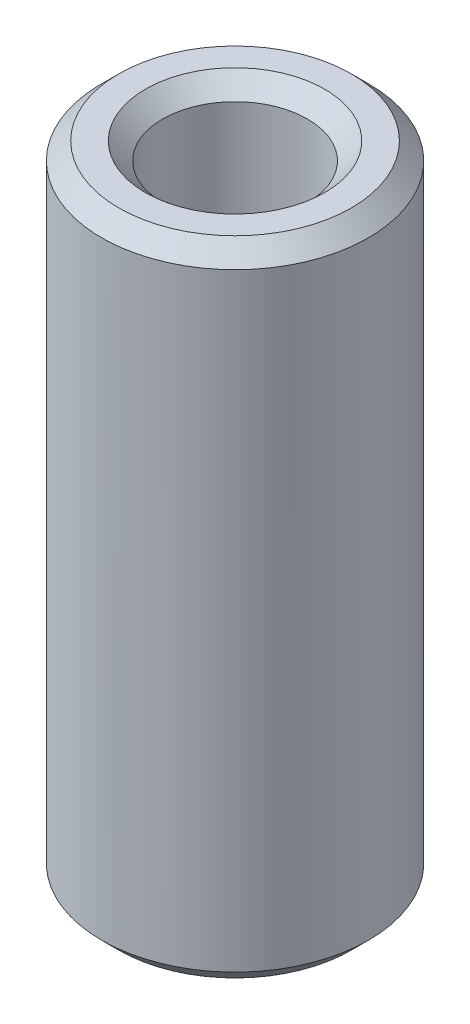
ISO-10303-21;
HEADER;
FILE_DESCRIPTION(('STEP AP214'),'2;1');
FILE_NAME('part.step','',(''),(''),'','','');
FILE_SCHEMA(('AUTOMOTIVE_DESIGN { 1 0 10303 214 1 1 1 1 }'));
ENDSEC;
DATA;
#1=APPLICATION_CONTEXT('core data for automotive mechanical design processes');
#2=APPLICATION_PROTOCOL_DEFINITION('international standard','automotive_design',2000,#1);
#3=PRODUCT_CONTEXT('',#1,'mechanical');
#4=PRODUCT('Part','Part','',(#3));
#5=PRODUCT_RELATED_PRODUCT_CATEGORY('part','',(#4));
#6=PRODUCT_DEFINITION_FORMATION('','',#4);
#7=PRODUCT_DEFINITION_CONTEXT('part definition',#1,'design');
#8=PRODUCT_DEFINITION('design','',#6,#7);
#9=PRODUCT_DEFINITION_SHAPE('','',#8);
#10=(LENGTH_UNIT() NAMED_UNIT(*) SI_UNIT(.MILLI.,.METRE.));
#11=(NAMED_UNIT(*) PLANE_ANGLE_UNIT() SI_UNIT($,.RADIAN.));
#12=(NAMED_UNIT(*) SI_UNIT($,.STERADIAN.) SOLID_ANGLE_UNIT());
#13=UNCERTAINTY_MEASURE_WITH_UNIT(LENGTH_MEASURE(1.E-05),#10,'distance_accuracy_value','');
#14=(GEOMETRIC_REPRESENTATION_CONTEXT(3) GLOBAL_UNCERTAINTY_ASSIGNED_CONTEXT((#13)) GLOBAL_UNIT_ASSIGNED_CONTEXT((#10,
#11,#12)) REPRESENTATION_CONTEXT('',''));
#15=CARTESIAN_POINT('',(0.,0.,0.));
#16=DIRECTION('',(0.,0.,1.));
#17=DIRECTION('',(1.,0.,0.));
#18=AXIS2_PLACEMENT_3D('',#15,#16,#17);
#19=CARTESIAN_POINT('',(0.,120.422147290837,0.));
#20=DIRECTION('',(0.,-1.,0.));
#21=DIRECTION('',(0.,0.,-1.));
#22=AXIS2_PLACEMENT_3D('',#19,#20,#21);
#23=CYLINDRICAL_SURFACE('',#22,25.);
#24=CARTESIAN_POINT('',(0.,3.22529616315824,0.));
#25=DIRECTION('',(0.,1.,0.));
#26=DIRECTION('',(0.,0.,1.));
#27=AXIS2_PLACEMENT_3D('',#24,#25,#26);
#28=CIRCLE('',#27,25.);
#29=CARTESIAN_POINT('',(0.,3.22529616315824,-25.));
#30=VERTEX_POINT('',#29);
#31=EDGE_CURVE('E10',#30,#30,#28,.T.);
#32=CARTESIAN_POINT('',(0.,117.196851127679,0.));
#33=DIRECTION('',(0.,1.,0.));
#34=DIRECTION('',(0.,0.,1.));
#35=AXIS2_PLACEMENT_3D('',#32,#33,#34);
#36=CIRCLE('',#35,25.);
#37=CARTESIAN_POINT('',(0.,117.196851127679,-25.));
#38=VERTEX_POINT('',#37);
#39=EDGE_CURVE('E50',#38,#38,#36,.F.);
#40=CARTESIAN_POINT('',(0.,3.22529616315824,-25.));
#41=CARTESIAN_POINT('',(0.,4.41249986070534,-25.));
#42=CARTESIAN_POINT('',(0.,5.59970355825243,-25.));
#43=CARTESIAN_POINT('',(0.,7.97411095334662,-25.));
#44=CARTESIAN_POINT('',(0.,9.16131465089371,-25.));
#45=CARTESIAN_POINT('',(0.,11.5357220459879,-25.));
#46=CARTESIAN_POINT('',(0.,12.722925743535,-25.));
#47=CARTESIAN_POINT('',(0.,15.0973331386292,-25.));
#48=CARTESIAN_POINT('',(0.,16.2845368361763,-25.));
#49=CARTESIAN_POINT('',(0.,18.6589442312705,-25.));
#50=CARTESIAN_POINT('',(0.,19.8461479288176,-25.));
#51=CARTESIAN_POINT('',(0.,22.2205553239118,-25.));
#52=CARTESIAN_POINT('',(0.,23.4077590214589,-25.));
#53=CARTESIAN_POINT('',(0.,25.782166416553,-25.));
#54=CARTESIAN_POINT('',(0.,26.9693701141001,-25.));
#55=CARTESIAN_POINT('',(0.,29.3437775091943,-25.));
#56=CARTESIAN_POINT('',(0.,30.5309812067414,-25.));
#57=CARTESIAN_POINT('',(0.,32.9053886018356,-25.));
#58=CARTESIAN_POINT('',(0.,34.0925922993827,-25.));
#59=CARTESIAN_POINT('',(0.,36.4669996944769,-25.));
#60=CARTESIAN_POINT('',(0.,37.654203392024,-25.));
#61=CARTESIAN_POINT('',(0.,40.0286107871182,-25.));
#62=CARTESIAN_POINT('',(0.,41.2158144846653,-25.));
#63=CARTESIAN_POINT('',(0.,43.5902218797595,-25.));
#64=CARTESIAN_POINT('',(0.,44.7774255773066,-25.));
#65=CARTESIAN_POINT('',(0.,47.1518329724007,-25.));
#66=CARTESIAN_POINT('',(0.,48.3390366699478,-25.));
#67=CARTESIAN_POINT('',(0.,50.713444065042,-25.));
#68=CARTESIAN_POINT('',(0.,51.9006477625891,-25.));
#69=CARTESIAN_POINT('',(0.,54.2750551576833,-25.));
#70=CARTESIAN_POINT('',(0.,55.4622588552304,-25.));
#71=CARTESIAN_POINT('',(0.,57.8366662503246,-25.));
#72=CARTESIAN_POINT('',(0.,59.0238699478717,-25.));
#73=CARTESIAN_POINT('',(0.,61.3982773429659,-25.));
#74=CARTESIAN_POINT('',(0.,62.585481040513,-25.));
#75=CARTESIAN_POINT('',(0.,64.9598884356071,-25.));
#76=CARTESIAN_POINT('',(0.,66.1470921331542,-25.));
#77=CARTESIAN_POINT('',(0.,68.5214995282484,-25.));
#78=CARTESIAN_POINT('',(0.,69.7087032257955,-25.));
#79=CARTESIAN_POINT('',(0.,72.0831106208897,-25.));
#80=CARTESIAN_POINT('',(0.,73.2703143184368,-25.));
#81=CARTESIAN_POINT('',(0.,75.644721713531,-25.));
#82=CARTESIAN_POINT('',(0.,76.8319254110781,-25.));
#83=CARTESIAN_POINT('',(0.,79.2063328061723,-25.));
#84=CARTESIAN_POINT('',(0.,80.3935365037194,-25.));
#85=CARTESIAN_POINT('',(0.,82.7679438988136,-25.));
#86=CARTESIAN_POINT('',(0.,83.9551475963607,-25.));
#87=CARTESIAN_POINT('',(0.,86.3295549914549,-25.));
#88=CARTESIAN_POINT('',(0.,87.5167586890019,-25.));
#89=CARTESIAN_POINT('',(0.,89.8911660840961,-25.));
#90=CARTESIAN_POINT('',(0.,91.0783697816432,-25.));
#91=CARTESIAN_POINT('',(0.,93.4527771767374,-25.));
#92=CARTESIAN_POINT('',(0.,94.6399808742845,-25.));
#93=CARTESIAN_POINT('',(0.,97.0143882693787,-25.));
#94=CARTESIAN_POINT('',(0.,98.2015919669258,-25.));
#95=CARTESIAN_POINT('',(0.,100.57599936202,-25.));
#96=CARTESIAN_POINT('',(0.,101.763203059567,-25.));
#97=CARTESIAN_POINT('',(0.,104.137610454661,-25.));
#98=CARTESIAN_POINT('',(0.,105.324814152208,-25.));
#99=CARTESIAN_POINT('',(0.,107.699221547303,-25.));
#100=CARTESIAN_POINT('',(0.,108.88642524485,-25.));
#101=CARTESIAN_POINT('',(0.,111.260832639944,-25.));
#102=CARTESIAN_POINT('',(0.,112.448036337491,-25.));
#103=CARTESIAN_POINT('',(0.,114.822443732585,-25.));
#104=CARTESIAN_POINT('',(0.,116.009647430132,-25.));
#105=CARTESIAN_POINT('',(0.,117.196851127679,-25.));
#106=B_SPLINE_CURVE_WITH_KNOTS('',3,(#40,#41,#42,#43,#44,#45,#46,#47,#48,#49,#50,#51,#52,#53,
#54,#55,#56,#57,#58,#59,#60,#61,#62,#63,#64,#65,#66,#67,#68,#69,#70,#71,#72,#73,#74,#75,#76,#77,
#78,#79,#80,#81,#82,#83,#84,#85,#86,#87,#88,#89,#90,#91,#92,#93,#94,#95,#96,#97,#98,#99,#100,
#101,#102,#103,#104,#105),.UNSPECIFIED.,.F.,.F.,(4,2,2,2,2,2,2,2,2,2,2,2,2,2,2,2,2,2,2,2,2,2,2,
2,2,2,2,2,2,2,2,2,4),(0.,3.56161109264129,7.12322218528257,10.6848332779239,14.2464443705651,
17.8080554632064,21.3696665558477,24.931277648489,28.4928887411303,32.0544998337716,
35.6161109264128,39.1777220190541,42.7393331116954,46.3009442043367,49.862555296978,
53.4241663896193,56.9857774822605,60.5473885749018,64.1089996675431,67.6706107601844,
71.2322218528257,74.7938329454669,78.3554440381082,81.9170551307495,85.4786662233908,
89.0402773160321,92.6018884086734,96.1634995013146,99.7251105939559,103.286721686597,
106.848332779239,110.40994387188,113.971554964521),.UNSPECIFIED.);
#107=EDGE_CURVE('BSEAM39',#30,#38,#106,.T.);
#108=ORIENTED_EDGE('',*,*,#31,.T.);
#109=ORIENTED_EDGE('',*,*,#39,.T.);
#110=ORIENTED_EDGE('',*,*,#107,.T.);
#111=ORIENTED_EDGE('',*,*,#107,.F.);
#112=EDGE_LOOP('',(#108,#110,#109,#111));
#113=FACE_BOUND('',#112,.T.);
#114=ADVANCED_FACE('F39',(#113),#23,.T.);
#115=CARTESIAN_POINT('',(0.,120.422147290837,0.));
#116=DIRECTION('',(0.,1.,0.));
#117=DIRECTION('',(0.,0.,1.));
#118=AXIS2_PLACEMENT_3D('',#115,#116,#117);
#119=PLANE('',#118);
#120=CARTESIAN_POINT('',(0.,120.422147290837,0.));
#121=DIRECTION('',(0.,1.,0.));
#122=DIRECTION('',(0.,0.,1.));
#123=AXIS2_PLACEMENT_3D('',#120,#121,#122);
#124=CIRCLE('',#123,16.7939794183931);
#125=CARTESIAN_POINT('',(0.,120.422147290837,16.7939794183931));
#126=VERTEX_POINT('',#125);
#127=EDGE_CURVE('E58',#126,#126,#124,.F.);
#128=ORIENTED_EDGE('',*,*,#127,.T.);
#129=EDGE_LOOP('',(#128));
#130=FACE_BOUND('',#129,.T.);
#131=CARTESIAN_POINT('',(0.,120.422147290837,0.));
#132=DIRECTION('',(0.,1.,0.));
#133=DIRECTION('',(0.,0.,1.));
#134=AXIS2_PLACEMENT_3D('',#131,#132,#133);
#135=CIRCLE('',#134,21.7747038368419);
#136=CARTESIAN_POINT('',(0.,120.422147290837,21.7747038368419));
#137=VERTEX_POINT('',#136);
#138=EDGE_CURVE('E61',#137,#137,#135,.T.);
#139=ORIENTED_EDGE('',*,*,#138,.T.);
#140=EDGE_LOOP('',(#139));
#141=FACE_BOUND('',#140,.T.);
#142=ADVANCED_FACE('F88',(#130,#141),#119,.T.);
#143=CARTESIAN_POINT('',(0.,0.,0.));
#144=DIRECTION('',(0.,1.,0.));
#145=DIRECTION('',(0.,0.,1.));
#146=AXIS2_PLACEMENT_3D('',#143,#144,#145);
#147=PLANE('',#146);
#148=CARTESIAN_POINT('',(0.,0.,0.));
#149=DIRECTION('',(0.,1.,0.));
#150=DIRECTION('',(0.,0.,1.));
#151=AXIS2_PLACEMENT_3D('',#148,#149,#150);
#152=CIRCLE('',#151,16.793979418393);
#153=CARTESIAN_POINT('',(0.,0.,16.793979418393));
#154=VERTEX_POINT('',#153);
#155=EDGE_CURVE('E51',#154,#154,#152,.T.);
#156=ORIENTED_EDGE('',*,*,#155,.T.);
#157=EDGE_LOOP('',(#156));
#158=FACE_BOUND('',#157,.T.);
#159=CARTESIAN_POINT('',(0.,0.,0.));
#160=DIRECTION('',(0.,1.,0.));
#161=DIRECTION('',(0.,0.,1.));
#162=AXIS2_PLACEMENT_3D('',#159,#160,#161);
#163=CIRCLE('',#162,21.7747038368417);
#164=CARTESIAN_POINT('',(0.,0.,21.7747038368417));
#165=VERTEX_POINT('',#164);
#166=EDGE_CURVE('E54',#165,#165,#163,.F.);
#167=ORIENTED_EDGE('',*,*,#166,.T.);
#168=EDGE_LOOP('',(#167));
#169=FACE_BOUND('',#168,.T.);
#170=ADVANCED_FACE('F83',(#158,#169),#147,.F.);
#171=CARTESIAN_POINT('',(0.,120.422147290837,0.));
#172=DIRECTION('',(0.,-1.,0.));
#173=DIRECTION('',(0.,0.,-1.));
#174=AXIS2_PLACEMENT_3D('',#171,#172,#173);
#175=CYLINDRICAL_SURFACE('',#174,13.5686832552349);
#176=CARTESIAN_POINT('',(0.,117.196851127679,0.));
#177=DIRECTION('',(0.,1.,0.));
#178=DIRECTION('',(0.,0.,1.));
#179=AXIS2_PLACEMENT_3D('',#176,#177,#178);
#180=CIRCLE('',#179,13.5686832552349);
#181=CARTESIAN_POINT('',(0.,117.196851127679,-13.5686832552349));
#182=VERTEX_POINT('',#181);
#183=EDGE_CURVE('E67',#182,#182,#180,.T.);
#184=CARTESIAN_POINT('',(0.,3.22529616315817,0.));
#185=DIRECTION('',(0.,1.,0.));
#186=DIRECTION('',(0.,0.,1.));
#187=AXIS2_PLACEMENT_3D('',#184,#185,#186);
#188=CIRCLE('',#187,13.5686832552349);
#189=CARTESIAN_POINT('',(0.,3.22529616315816,-13.5686832552349));
#190=VERTEX_POINT('',#189);
#191=EDGE_CURVE('E69',#190,#190,#188,.F.);
#192=CARTESIAN_POINT('',(0.,117.196851127679,-13.5686832552349));
#193=CARTESIAN_POINT('',(0.,116.009647430132,-13.5686832552349));
#194=CARTESIAN_POINT('',(0.,114.822443732585,-13.5686832552349));
#195=CARTESIAN_POINT('',(0.,112.448036337491,-13.5686832552349));
#196=CARTESIAN_POINT('',(0.,111.260832639944,-13.5686832552349));
#197=CARTESIAN_POINT('',(0.,108.886425244849,-13.5686832552349));
#198=CARTESIAN_POINT('',(0.,107.699221547302,-13.5686832552349));
#199=CARTESIAN_POINT('',(0.,105.324814152208,-13.5686832552349));
#200=CARTESIAN_POINT('',(0.,104.137610454661,-13.5686832552349));
#201=CARTESIAN_POINT('',(0.,101.763203059567,-13.5686832552349));
#202=CARTESIAN_POINT('',(0.,100.57599936202,-13.5686832552349));
#203=CARTESIAN_POINT('',(0.,98.2015919669257,-13.5686832552349));
#204=CARTESIAN_POINT('',(0.,97.0143882693786,-13.5686832552349));
#205=CARTESIAN_POINT('',(0.,94.6399808742844,-13.5686832552349));
#206=CARTESIAN_POINT('',(0.,93.4527771767373,-13.5686832552349));
#207=CARTESIAN_POINT('',(0.,91.0783697816431,-13.5686832552349));
#208=CARTESIAN_POINT('',(0.,89.891166084096,-13.5686832552349));
#209=CARTESIAN_POINT('',(0.,87.5167586890018,-13.5686832552349));
#210=CARTESIAN_POINT('',(0.,86.3295549914547,-13.5686832552349));
#211=CARTESIAN_POINT('',(0.,83.9551475963605,-13.5686832552349));
#212=CARTESIAN_POINT('',(0.,82.7679438988134,-13.5686832552349));
#213=CARTESIAN_POINT('',(0.,80.3935365037193,-13.5686832552349));
#214=CARTESIAN_POINT('',(0.,79.2063328061722,-13.5686832552349));
#215=CARTESIAN_POINT('',(0.,76.831925411078,-13.5686832552349));
#216=CARTESIAN_POINT('',(0.,75.6447217135309,-13.5686832552349));
#217=CARTESIAN_POINT('',(0.,73.2703143184367,-13.5686832552349));
#218=CARTESIAN_POINT('',(0.,72.0831106208896,-13.5686832552349));
#219=CARTESIAN_POINT('',(0.,69.7087032257954,-13.5686832552349));
#220=CARTESIAN_POINT('',(0.,68.5214995282483,-13.5686832552349));
#221=CARTESIAN_POINT('',(0.,66.1470921331541,-13.5686832552349));
#222=CARTESIAN_POINT('',(0.,64.959888435607,-13.5686832552349));
#223=CARTESIAN_POINT('',(0.,62.5854810405129,-13.5686832552349));
#224=CARTESIAN_POINT('',(0.,61.3982773429658,-13.5686832552349));
#225=CARTESIAN_POINT('',(0.,59.0238699478716,-13.5686832552349));
#226=CARTESIAN_POINT('',(0.,57.8366662503245,-13.5686832552349));
#227=CARTESIAN_POINT('',(0.,55.4622588552303,-13.5686832552349));
#228=CARTESIAN_POINT('',(0.,54.2750551576832,-13.5686832552349));
#229=CARTESIAN_POINT('',(0.,51.900647762589,-13.5686832552349));
#230=CARTESIAN_POINT('',(0.,50.7134440650419,-13.5686832552349));
#231=CARTESIAN_POINT('',(0.,48.3390366699477,-13.5686832552349));
#232=CARTESIAN_POINT('',(0.,47.1518329724006,-13.5686832552349));
#233=CARTESIAN_POINT('',(0.,44.7774255773064,-13.5686832552349));
#234=CARTESIAN_POINT('',(0.,43.5902218797593,-13.5686832552349));
#235=CARTESIAN_POINT('',(0.,41.2158144846652,-13.5686832552349));
#236=CARTESIAN_POINT('',(0.,40.0286107871181,-13.5686832552349));
#237=CARTESIAN_POINT('',(0.,37.6542033920239,-13.5686832552349));
#238=CARTESIAN_POINT('',(0.,36.4669996944768,-13.5686832552349));
#239=CARTESIAN_POINT('',(0.,34.0925922993826,-13.5686832552349));
#240=CARTESIAN_POINT('',(0.,32.9053886018355,-13.5686832552349));
#241=CARTESIAN_POINT('',(0.,30.5309812067413,-13.5686832552349));
#242=CARTESIAN_POINT('',(0.,29.3437775091942,-13.5686832552349));
#243=CARTESIAN_POINT('',(0.,26.9693701141,-13.5686832552349));
#244=CARTESIAN_POINT('',(0.,25.7821664165529,-13.5686832552349));
#245=CARTESIAN_POINT('',(0.,23.4077590214587,-13.5686832552349));
#246=CARTESIAN_POINT('',(0.,22.2205553239117,-13.5686832552349));
#247=CARTESIAN_POINT('',(0.,19.8461479288175,-13.5686832552349));
#248=CARTESIAN_POINT('',(0.,18.6589442312704,-13.5686832552349));
#249=CARTESIAN_POINT('',(0.,16.2845368361762,-13.5686832552349));
#250=CARTESIAN_POINT('',(0.,15.0973331386291,-13.5686832552349));
#251=CARTESIAN_POINT('',(0.,12.7229257435349,-13.5686832552349));
#252=CARTESIAN_POINT('',(0.,11.5357220459878,-13.5686832552349));
#253=CARTESIAN_POINT('',(0.,9.16131465089363,-13.5686832552349));
#254=CARTESIAN_POINT('',(0.,7.97411095334653,-13.5686832552349));
#255=CARTESIAN_POINT('',(0.,5.59970355825234,-13.5686832552349));
#256=CARTESIAN_POINT('',(0.,4.41249986070525,-13.5686832552349));
#257=CARTESIAN_POINT('',(0.,3.22529616315816,-13.5686832552349));
#258=B_SPLINE_CURVE_WITH_KNOTS('',3,(#192,#193,#194,#195,#196,#197,#198,#199,#200,#201,#202,
#203,#204,#205,#206,#207,#208,#209,#210,#211,#212,#213,#214,#215,#216,#217,#218,#219,#220,#221,
#222,#223,#224,#225,#226,#227,#228,#229,#230,#231,#232,#233,#234,#235,#236,#237,#238,#239,#240,
#241,#242,#243,#244,#245,#246,#247,#248,#249,#250,#251,#252,#253,#254,#255,#256,#257),
.UNSPECIFIED.,.F.,.F.,(4,2,2,2,2,2,2,2,2,2,2,2,2,2,2,2,2,2,2,2,2,2,2,2,2,2,2,2,2,2,2,2,4),(0.,
3.56161109264128,7.12322218528255,10.6848332779238,14.2464443705651,17.8080554632064,
21.3696665558477,24.931277648489,28.4928887411302,32.0544998337715,35.6161109264128,
39.1777220190541,42.7393331116954,46.3009442043367,49.8625552969779,53.4241663896192,
56.9857774822605,60.5473885749018,64.108999667543,67.6706107601843,71.2322218528256,
74.7938329454669,78.3554440381082,81.9170551307495,85.4786662233907,89.040277316032,
92.6018884086733,96.1634995013146,99.7251105939559,103.286721686597,106.848332779238,
110.40994387188,113.971554964521),.UNSPECIFIED.);
#259=EDGE_CURVE('BSEAM71',#182,#190,#258,.T.);
#260=ORIENTED_EDGE('',*,*,#183,.T.);
#261=ORIENTED_EDGE('',*,*,#191,.T.);
#262=ORIENTED_EDGE('',*,*,#259,.T.);
#263=ORIENTED_EDGE('',*,*,#259,.F.);
#264=EDGE_LOOP('',(#260,#262,#261,#263));
#265=FACE_BOUND('',#264,.T.);
#266=ADVANCED_FACE('F71',(#265),#175,.F.);
#267=CARTESIAN_POINT('',(0.,117.196851127679,0.));
#268=DIRECTION('',(0.,1.,0.));
#269=DIRECTION('',(0.,0.,1.));
#270=AXIS2_PLACEMENT_3D('',#267,#268,#269);
#271=CONICAL_SURFACE('',#270,13.5686832552349,0.78539816339745);
#272=ORIENTED_EDGE('',*,*,#127,.F.);
#273=EDGE_LOOP('',(#272));
#274=FACE_BOUND('',#273,.T.);
#275=ORIENTED_EDGE('',*,*,#183,.F.);
#276=EDGE_LOOP('',(#275));
#277=FACE_BOUND('',#276,.T.);
#278=ADVANCED_FACE('F77',(#274,#277),#271,.F.);
#279=CARTESIAN_POINT('',(0.,0.,0.));
#280=DIRECTION('',(0.,-1.,0.));
#281=DIRECTION('',(0.,0.,-1.));
#282=AXIS2_PLACEMENT_3D('',#279,#280,#281);
#283=CONICAL_SURFACE('',#282,16.793979418393,0.785398163397446);
#284=ORIENTED_EDGE('',*,*,#191,.F.);
#285=EDGE_LOOP('',(#284));
#286=FACE_BOUND('',#285,.T.);
#287=ORIENTED_EDGE('',*,*,#155,.F.);
#288=EDGE_LOOP('',(#287));
#289=FACE_BOUND('',#288,.T.);
#290=ADVANCED_FACE('F73',(#286,#289),#283,.F.);
#291=CARTESIAN_POINT('',(0.,3.22529616315824,0.));
#292=DIRECTION('',(0.,1.,0.));
#293=DIRECTION('',(0.,0.,1.));
#294=AXIS2_PLACEMENT_3D('',#291,#292,#293);
#295=CONICAL_SURFACE('',#294,25.,0.785398163397452);
#296=ORIENTED_EDGE('',*,*,#166,.F.);
#297=EDGE_LOOP('',(#296));
#298=FACE_BOUND('',#297,.T.);
#299=ORIENTED_EDGE('',*,*,#31,.F.);
#300=EDGE_LOOP('',(#299));
#301=FACE_BOUND('',#300,.T.);
#302=ADVANCED_FACE('F76',(#298,#301),#295,.T.);
#303=CARTESIAN_POINT('',(0.,120.422147290837,0.));
#304=DIRECTION('',(0.,-1.,0.));
#305=DIRECTION('',(0.,0.,-1.));
#306=AXIS2_PLACEMENT_3D('',#303,#304,#305);
#307=CONICAL_SURFACE('',#306,21.7747038368419,0.785398163397446);
#308=ORIENTED_EDGE('',*,*,#39,.F.);
#309=EDGE_LOOP('',(#308));
#310=FACE_BOUND('',#309,.T.);
#311=ORIENTED_EDGE('',*,*,#138,.F.);
#312=EDGE_LOOP('',(#311));
#313=FACE_BOUND('',#312,.T.);
#314=ADVANCED_FACE('F45',(#310,#313),#307,.T.);
#315=CLOSED_SHELL('',(#114,#142,#170,#266,#278,#290,#302,#314));
#316=MANIFOLD_SOLID_BREP('B2',#315);
#317=ADVANCED_BREP_SHAPE_REPRESENTATION('',(#18,#316),#14);
#318=SHAPE_DEFINITION_REPRESENTATION(#9,#317);
ENDSEC;
END-ISO-10303-21;
